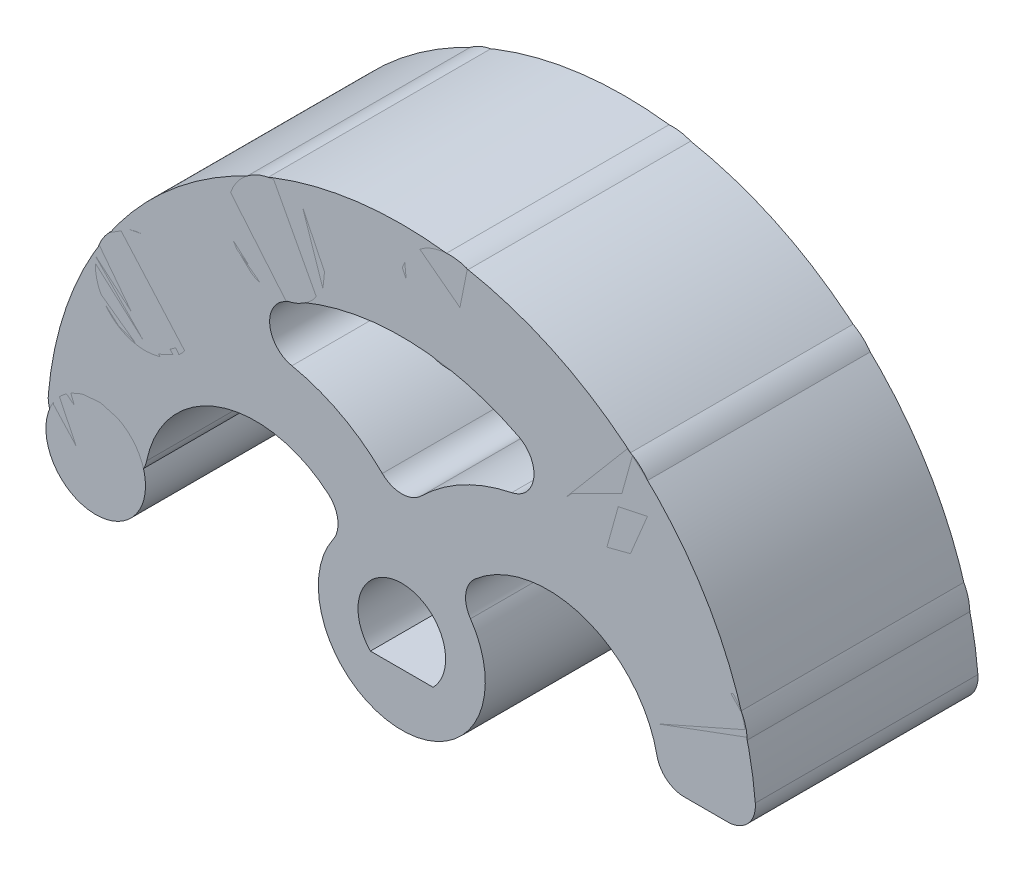
ISO-10303-21;
HEADER;
FILE_DESCRIPTION(('STEP AP214'),'2;1');
FILE_NAME('part.step','',(''),(''),'','','');
FILE_SCHEMA(('AUTOMOTIVE_DESIGN { 1 0 10303 214 1 1 1 1 }'));
ENDSEC;
DATA;
#1=APPLICATION_CONTEXT('core data for automotive mechanical design processes');
#2=APPLICATION_PROTOCOL_DEFINITION('international standard','automotive_design',2000,#1);
#3=PRODUCT_CONTEXT('',#1,'mechanical');
#4=PRODUCT('Part','Part','',(#3));
#5=PRODUCT_RELATED_PRODUCT_CATEGORY('part','',(#4));
#6=PRODUCT_DEFINITION_FORMATION('','',#4);
#7=PRODUCT_DEFINITION_CONTEXT('part definition',#1,'design');
#8=PRODUCT_DEFINITION('design','',#6,#7);
#9=PRODUCT_DEFINITION_SHAPE('','',#8);
#10=(LENGTH_UNIT() NAMED_UNIT(*) SI_UNIT(.MILLI.,.METRE.));
#11=(NAMED_UNIT(*) PLANE_ANGLE_UNIT() SI_UNIT($,.RADIAN.));
#12=(NAMED_UNIT(*) SI_UNIT($,.STERADIAN.) SOLID_ANGLE_UNIT());
#13=UNCERTAINTY_MEASURE_WITH_UNIT(LENGTH_MEASURE(1.E-05),#10,'distance_accuracy_value','');
#14=(GEOMETRIC_REPRESENTATION_CONTEXT(3) GLOBAL_UNCERTAINTY_ASSIGNED_CONTEXT((#13)) GLOBAL_UNIT_ASSIGNED_CONTEXT((#10,
#11,#12)) REPRESENTATION_CONTEXT('',''));
#15=CARTESIAN_POINT('',(0.,0.,0.));
#16=DIRECTION('',(0.,0.,1.));
#17=DIRECTION('',(1.,0.,0.));
#18=AXIS2_PLACEMENT_3D('',#15,#16,#17);
#19=CARTESIAN_POINT('',(10.6251840891798,2.84700949612767,0.));
#20=DIRECTION('',(0.,0.,1.));
#21=DIRECTION('',(-0.96592582628907,-0.258819045102516,0.));
#22=AXIS2_PLACEMENT_3D('',#19,#20,#21);
#23=CYLINDRICAL_SURFACE('',#22,1.78981093410736);
#24=CARTESIAN_POINT('',(10.6251840891798,2.84700949612767,0.));
#25=DIRECTION('',(0.,0.,1.));
#26=DIRECTION('',(-0.96592582628907,-0.258819045102516,0.));
#27=AXIS2_PLACEMENT_3D('',#24,#25,#26);
#28=CIRCLE('',#27,1.78981093410736);
#29=CARTESIAN_POINT('',(8.8963594837509,2.38377233924796,0.));
#30=VERTEX_POINT('',#29);
#31=EDGE_CURVE('P0_E11',#30,#30,#28,.T.);
#32=ORIENTED_EDGE('',*,*,#31,.T.);
#33=EDGE_LOOP('',(#32));
#34=FACE_BOUND('',#33,.T.);
#35=CARTESIAN_POINT('',(10.6251840891798,2.84700949612767,8.));
#36=DIRECTION('',(0.,0.,1.));
#37=DIRECTION('',(-0.96592582628907,-0.258819045102516,0.));
#38=AXIS2_PLACEMENT_3D('',#35,#36,#37);
#39=CIRCLE('',#38,1.78981093410736);
#40=CARTESIAN_POINT('',(8.8963594837509,2.38377233924796,8.));
#41=VERTEX_POINT('',#40);
#42=EDGE_CURVE('P0_E47',#41,#41,#39,.T.);
#43=ORIENTED_EDGE('',*,*,#42,.F.);
#44=EDGE_LOOP('',(#43));
#45=FACE_BOUND('',#44,.T.);
#46=ADVANCED_FACE('P0_F44',(#34,#45),#23,.T.);
#47=CARTESIAN_POINT('',(10.6251840891798,2.84700949612767,0.));
#48=DIRECTION('',(0.,0.,1.));
#49=DIRECTION('',(-0.96592582628907,-0.258819045102516,0.));
#50=AXIS2_PLACEMENT_3D('',#47,#48,#49);
#51=PLANE('',#50);
#52=ORIENTED_EDGE('',*,*,#31,.F.);
#53=EDGE_LOOP('',(#52));
#54=FACE_BOUND('',#53,.T.);
#55=ADVANCED_FACE('P0_F59',(#54),#51,.F.);
#56=CARTESIAN_POINT('',(10.6251840891798,2.84700949612767,8.));
#57=DIRECTION('',(0.,0.,1.));
#58=DIRECTION('',(-0.96592582628907,-0.258819045102516,0.));
#59=AXIS2_PLACEMENT_3D('',#56,#57,#58);
#60=PLANE('',#59);
#61=ORIENTED_EDGE('',*,*,#42,.T.);
#62=EDGE_LOOP('',(#61));
#63=FACE_BOUND('',#62,.T.);
#64=ADVANCED_FACE('P0_F56',(#63),#60,.T.);
#65=CLOSED_SHELL('',(#46,#55,#64));
#66=MANIFOLD_SOLID_BREP('P0_B2',#65);
#67=CARTESIAN_POINT('',(7.36043666994747,8.17459308025131,0.));
#68=DIRECTION('',(0.,0.,1.));
#69=DIRECTION('',(-0.669130606358861,-0.743144825477392,0.));
#70=AXIS2_PLACEMENT_3D('',#67,#68,#69);
#71=CYLINDRICAL_SURFACE('',#70,1.78981093410736);
#72=CARTESIAN_POINT('',(7.36043666994747,8.17459308025131,0.));
#73=DIRECTION('',(0.,0.,1.));
#74=DIRECTION('',(-0.669130606358861,-0.743144825477392,0.));
#75=AXIS2_PLACEMENT_3D('',#72,#73,#74);
#76=CIRCLE('',#75,1.78981093410736);
#77=CARTESIAN_POINT('',(6.16281939434049,6.84450434598656,0.));
#78=VERTEX_POINT('',#77);
#79=EDGE_CURVE('P0_E43',#78,#78,#76,.T.);
#80=ORIENTED_EDGE('',*,*,#79,.T.);
#81=EDGE_LOOP('',(#80));
#82=FACE_BOUND('',#81,.T.);
#83=CARTESIAN_POINT('',(7.36043666994747,8.17459308025131,8.));
#84=DIRECTION('',(0.,0.,1.));
#85=DIRECTION('',(-0.669130606358861,-0.743144825477392,0.));
#86=AXIS2_PLACEMENT_3D('',#83,#84,#85);
#87=CIRCLE('',#86,1.78981093410736);
#88=CARTESIAN_POINT('',(6.16281939434049,6.84450434598656,8.));
#89=VERTEX_POINT('',#88);
#90=EDGE_CURVE('P0_E114',#89,#89,#87,.T.);
#91=ORIENTED_EDGE('',*,*,#90,.F.);
#92=EDGE_LOOP('',(#91));
#93=FACE_BOUND('',#92,.T.);
#94=ADVANCED_FACE('P0_F111',(#82,#93),#71,.T.);
#95=CARTESIAN_POINT('',(7.36043666994747,8.17459308025131,0.));
#96=DIRECTION('',(0.,0.,1.));
#97=DIRECTION('',(-0.669130606358861,-0.743144825477392,0.));
#98=AXIS2_PLACEMENT_3D('',#95,#96,#97);
#99=PLANE('',#98);
#100=ORIENTED_EDGE('',*,*,#79,.F.);
#101=EDGE_LOOP('',(#100));
#102=FACE_BOUND('',#101,.T.);
#103=ADVANCED_FACE('P0_F126',(#102),#99,.F.);
#104=CARTESIAN_POINT('',(7.36043666994747,8.17459308025131,8.));
#105=DIRECTION('',(0.,0.,1.));
#106=DIRECTION('',(-0.669130606358861,-0.743144825477392,0.));
#107=AXIS2_PLACEMENT_3D('',#104,#105,#106);
#108=PLANE('',#107);
#109=ORIENTED_EDGE('',*,*,#90,.T.);
#110=EDGE_LOOP('',(#109));
#111=FACE_BOUND('',#110,.T.);
#112=ADVANCED_FACE('P0_F123',(#111),#108,.T.);
#113=CLOSED_SHELL('',(#94,#103,#112));
#114=MANIFOLD_SOLID_BREP('P0_B6',#113);
#115=CARTESIAN_POINT('',(1.72077911544257,10.8645717465465,0.));
#116=DIRECTION('',(0.,0.,1.));
#117=DIRECTION('',(-0.156434465040234,-0.987688340595137,0.));
#118=AXIS2_PLACEMENT_3D('',#115,#116,#117);
#119=CYLINDRICAL_SURFACE('',#118,1.78981093410736);
#120=CARTESIAN_POINT('',(1.72077911544257,10.8645717465465,0.));
#121=DIRECTION('',(0.,0.,1.));
#122=DIRECTION('',(-0.156434465040234,-0.987688340595137,0.));
#123=AXIS2_PLACEMENT_3D('',#120,#121,#122);
#124=CIRCLE('',#123,1.78981093410736);
#125=CARTESIAN_POINT('',(1.44079099944233,9.09679635505897,0.));
#126=VERTEX_POINT('',#125);
#127=EDGE_CURVE('P0_E110',#126,#126,#124,.T.);
#128=ORIENTED_EDGE('',*,*,#127,.T.);
#129=EDGE_LOOP('',(#128));
#130=FACE_BOUND('',#129,.T.);
#131=CARTESIAN_POINT('',(1.72077911544257,10.8645717465465,8.));
#132=DIRECTION('',(0.,0.,1.));
#133=DIRECTION('',(-0.156434465040234,-0.987688340595137,0.));
#134=AXIS2_PLACEMENT_3D('',#131,#132,#133);
#135=CIRCLE('',#134,1.78981093410736);
#136=CARTESIAN_POINT('',(1.44079099944233,9.09679635505897,8.));
#137=VERTEX_POINT('',#136);
#138=EDGE_CURVE('P0_E181',#137,#137,#135,.T.);
#139=ORIENTED_EDGE('',*,*,#138,.F.);
#140=EDGE_LOOP('',(#139));
#141=FACE_BOUND('',#140,.T.);
#142=ADVANCED_FACE('P0_F178',(#130,#141),#119,.T.);
#143=CARTESIAN_POINT('',(1.72077911544257,10.8645717465465,0.));
#144=DIRECTION('',(0.,0.,1.));
#145=DIRECTION('',(-0.156434465040234,-0.987688340595137,0.));
#146=AXIS2_PLACEMENT_3D('',#143,#144,#145);
#147=PLANE('',#146);
#148=ORIENTED_EDGE('',*,*,#127,.F.);
#149=EDGE_LOOP('',(#148));
#150=FACE_BOUND('',#149,.T.);
#151=ADVANCED_FACE('P0_F193',(#150),#147,.F.);
#152=CARTESIAN_POINT('',(1.72077911544257,10.8645717465465,8.));
#153=DIRECTION('',(0.,0.,1.));
#154=DIRECTION('',(-0.156434465040234,-0.987688340595137,0.));
#155=AXIS2_PLACEMENT_3D('',#152,#153,#154);
#156=PLANE('',#155);
#157=ORIENTED_EDGE('',*,*,#138,.T.);
#158=EDGE_LOOP('',(#157));
#159=FACE_BOUND('',#158,.T.);
#160=ADVANCED_FACE('P0_F190',(#159),#156,.T.);
#161=CLOSED_SHELL('',(#142,#151,#160));
#162=MANIFOLD_SOLID_BREP('P0_B38',#161);
#163=CARTESIAN_POINT('',(-4.47410307383378,10.0490000340686,0.));
#164=DIRECTION('',(0.,0.,1.));
#165=DIRECTION('',(0.406736643075798,-0.913545457642602,0.));
#166=AXIS2_PLACEMENT_3D('',#163,#164,#165);
#167=CYLINDRICAL_SURFACE('',#166,1.78981093410736);
#168=CARTESIAN_POINT('',(-4.47410307383378,10.0490000340686,0.));
#169=DIRECTION('',(0.,0.,1.));
#170=DIRECTION('',(0.406736643075798,-0.913545457642602,0.));
#171=AXIS2_PLACEMENT_3D('',#168,#169,#170);
#172=CIRCLE('',#171,1.78981093410736);
#173=CARTESIAN_POINT('',(-3.74612138275459,8.41392638517577,0.));
#174=VERTEX_POINT('',#173);
#175=EDGE_CURVE('P0_E177',#174,#174,#172,.T.);
#176=ORIENTED_EDGE('',*,*,#175,.T.);
#177=EDGE_LOOP('',(#176));
#178=FACE_BOUND('',#177,.T.);
#179=CARTESIAN_POINT('',(-4.47410307383378,10.0490000340686,8.));
#180=DIRECTION('',(0.,0.,1.));
#181=DIRECTION('',(0.406736643075798,-0.913545457642602,0.));
#182=AXIS2_PLACEMENT_3D('',#179,#180,#181);
#183=CIRCLE('',#182,1.78981093410736);
#184=CARTESIAN_POINT('',(-3.74612138275459,8.41392638517577,8.));
#185=VERTEX_POINT('',#184);
#186=EDGE_CURVE('P0_E248',#185,#185,#183,.T.);
#187=ORIENTED_EDGE('',*,*,#186,.F.);
#188=EDGE_LOOP('',(#187));
#189=FACE_BOUND('',#188,.T.);
#190=ADVANCED_FACE('P0_F245',(#178,#189),#167,.T.);
#191=CARTESIAN_POINT('',(-4.47410307383378,10.0490000340686,0.));
#192=DIRECTION('',(0.,0.,1.));
#193=DIRECTION('',(0.406736643075798,-0.913545457642602,0.));
#194=AXIS2_PLACEMENT_3D('',#191,#192,#193);
#195=PLANE('',#194);
#196=ORIENTED_EDGE('',*,*,#175,.F.);
#197=EDGE_LOOP('',(#196));
#198=FACE_BOUND('',#197,.T.);
#199=ADVANCED_FACE('P0_F260',(#198),#195,.F.);
#200=CARTESIAN_POINT('',(-4.47410307383378,10.0490000340686,8.));
#201=DIRECTION('',(0.,0.,1.));
#202=DIRECTION('',(0.406736643075798,-0.913545457642602,0.));
#203=AXIS2_PLACEMENT_3D('',#200,#201,#202);
#204=PLANE('',#203);
#205=ORIENTED_EDGE('',*,*,#186,.T.);
#206=EDGE_LOOP('',(#205));
#207=FACE_BOUND('',#206,.T.);
#208=ADVANCED_FACE('P0_F257',(#207),#204,.T.);
#209=CLOSED_SHELL('',(#190,#199,#208));
#210=MANIFOLD_SOLID_BREP('P0_B105',#209);
#211=CARTESIAN_POINT('',(-9.22537624739966,5.99102938516531,0.));
#212=DIRECTION('',(0.,0.,1.));
#213=DIRECTION('',(0.838670567945423,-0.544639035015028,0.));
#214=AXIS2_PLACEMENT_3D('',#211,#212,#213);
#215=CYLINDRICAL_SURFACE('',#214,1.78981093410736);
#216=CARTESIAN_POINT('',(-9.22537624739966,5.99102938516531,0.));
#217=DIRECTION('',(0.,0.,1.));
#218=DIRECTION('',(0.838670567945423,-0.544639035015028,0.));
#219=AXIS2_PLACEMENT_3D('',#216,#217,#218);
#220=CIRCLE('',#219,1.78981093410736);
#221=CARTESIAN_POINT('',(-7.72431449477691,5.01622848515373,0.));
#222=VERTEX_POINT('',#221);
#223=EDGE_CURVE('P0_E244',#222,#222,#220,.T.);
#224=ORIENTED_EDGE('',*,*,#223,.T.);
#225=EDGE_LOOP('',(#224));
#226=FACE_BOUND('',#225,.T.);
#227=CARTESIAN_POINT('',(-9.22537624739966,5.99102938516531,8.));
#228=DIRECTION('',(0.,0.,1.));
#229=DIRECTION('',(0.838670567945423,-0.544639035015028,0.));
#230=AXIS2_PLACEMENT_3D('',#227,#228,#229);
#231=CIRCLE('',#230,1.78981093410736);
#232=CARTESIAN_POINT('',(-7.72431449477691,5.01622848515373,8.));
#233=VERTEX_POINT('',#232);
#234=EDGE_CURVE('P0_E314',#233,#233,#231,.T.);
#235=ORIENTED_EDGE('',*,*,#234,.F.);
#236=EDGE_LOOP('',(#235));
#237=FACE_BOUND('',#236,.T.);
#238=ADVANCED_FACE('P0_F311',(#226,#237),#215,.T.);
#239=CARTESIAN_POINT('',(-9.22537624739966,5.99102938516531,0.));
#240=DIRECTION('',(0.,0.,1.));
#241=DIRECTION('',(0.838670567945423,-0.544639035015028,0.));
#242=AXIS2_PLACEMENT_3D('',#239,#240,#241);
#243=PLANE('',#242);
#244=ORIENTED_EDGE('',*,*,#223,.F.);
#245=EDGE_LOOP('',(#244));
#246=FACE_BOUND('',#245,.T.);
#247=ADVANCED_FACE('P0_F326',(#246),#243,.F.);
#248=CARTESIAN_POINT('',(-9.22537624739966,5.99102938516531,8.));
#249=DIRECTION('',(0.,0.,1.));
#250=DIRECTION('',(0.838670567945423,-0.544639035015028,0.));
#251=AXIS2_PLACEMENT_3D('',#248,#249,#250);
#252=PLANE('',#251);
#253=ORIENTED_EDGE('',*,*,#234,.T.);
#254=EDGE_LOOP('',(#253));
#255=FACE_BOUND('',#254,.T.);
#256=ADVANCED_FACE('P0_F323',(#255),#252,.T.);
#257=CLOSED_SHELL('',(#238,#247,#256));
#258=MANIFOLD_SOLID_BREP('P0_B172',#257);
#259=CARTESIAN_POINT('',(-11.,0.,0.));
#260=DIRECTION('',(0.,0.,1.));
#261=DIRECTION('',(1.,0.,0.));
#262=AXIS2_PLACEMENT_3D('',#259,#260,#261);
#263=CYLINDRICAL_SURFACE('',#262,1.78981093410736);
#264=CARTESIAN_POINT('',(-11.,0.,0.));
#265=DIRECTION('',(0.,0.,1.));
#266=DIRECTION('',(1.,0.,0.));
#267=AXIS2_PLACEMENT_3D('',#264,#265,#266);
#268=CIRCLE('',#267,1.78981093410736);
#269=CARTESIAN_POINT('',(-9.21018906589264,0.,0.));
#270=VERTEX_POINT('',#269);
#271=EDGE_CURVE('P0_E310',#270,#270,#268,.T.);
#272=ORIENTED_EDGE('',*,*,#271,.T.);
#273=EDGE_LOOP('',(#272));
#274=FACE_BOUND('',#273,.T.);
#275=CARTESIAN_POINT('',(-11.,0.,8.));
#276=DIRECTION('',(0.,0.,1.));
#277=DIRECTION('',(1.,0.,0.));
#278=AXIS2_PLACEMENT_3D('',#275,#276,#277);
#279=CIRCLE('',#278,1.78981093410736);
#280=CARTESIAN_POINT('',(-9.21018906589264,0.,8.));
#281=VERTEX_POINT('',#280);
#282=EDGE_CURVE('P0_E373',#281,#281,#279,.T.);
#283=ORIENTED_EDGE('',*,*,#282,.F.);
#284=EDGE_LOOP('',(#283));
#285=FACE_BOUND('',#284,.T.);
#286=ADVANCED_FACE('P0_F370',(#274,#285),#263,.T.);
#287=CARTESIAN_POINT('',(-11.,0.,0.));
#288=DIRECTION('',(0.,0.,1.));
#289=DIRECTION('',(1.,0.,0.));
#290=AXIS2_PLACEMENT_3D('',#287,#288,#289);
#291=PLANE('',#290);
#292=ORIENTED_EDGE('',*,*,#271,.F.);
#293=EDGE_LOOP('',(#292));
#294=FACE_BOUND('',#293,.T.);
#295=ADVANCED_FACE('P0_F385',(#294),#291,.F.);
#296=CARTESIAN_POINT('',(-11.,0.,8.));
#297=DIRECTION('',(0.,0.,1.));
#298=DIRECTION('',(1.,0.,0.));
#299=AXIS2_PLACEMENT_3D('',#296,#297,#298);
#300=PLANE('',#299);
#301=ORIENTED_EDGE('',*,*,#282,.T.);
#302=EDGE_LOOP('',(#301));
#303=FACE_BOUND('',#302,.T.);
#304=ADVANCED_FACE('P0_F382',(#303),#300,.T.);
#305=CLOSED_SHELL('',(#286,#295,#304));
#306=MANIFOLD_SOLID_BREP('P0_B239',#305);
#307=CARTESIAN_POINT('',(11.7073694739681,1.,8.));
#308=DIRECTION('',(0.,0.,1.));
#309=DIRECTION('',(1.,0.,0.));
#310=AXIS2_PLACEMENT_3D('',#307,#308,#309);
#311=CYLINDRICAL_SURFACE('',#310,1.);
#312=CARTESIAN_POINT('',(11.7073694739681,1.,8.));
#313=DIRECTION('',(0.,0.,-1.));
#314=DIRECTION('',(0.,-1.,0.));
#315=AXIS2_PLACEMENT_3D('',#312,#313,#314);
#316=CIRCLE('',#315,1.);
#317=CARTESIAN_POINT('',(12.703741344093,1.08510638297872,8.));
#318=VERTEX_POINT('',#317);
#319=CARTESIAN_POINT('',(11.7073694739681,0.,8.));
#320=VERTEX_POINT('',#319);
#321=EDGE_CURVE('P1_E11',#318,#320,#316,.T.);
#322=ORIENTED_EDGE('',*,*,#321,.T.);
#323=DIRECTION('',(0.,0.,-1.));
#324=VECTOR('',#323,1.);
#325=CARTESIAN_POINT('',(11.7073694739681,0.,8.));
#326=LINE('',#325,#324);
#327=CARTESIAN_POINT('',(11.7073694739681,0.,0.));
#328=VERTEX_POINT('',#327);
#329=EDGE_CURVE('P1_E26',#320,#328,#326,.T.);
#330=ORIENTED_EDGE('',*,*,#329,.T.);
#331=CARTESIAN_POINT('',(11.7073694739681,1.,0.));
#332=DIRECTION('',(0.,0.,1.));
#333=DIRECTION('',(1.,0.,0.));
#334=AXIS2_PLACEMENT_3D('',#331,#332,#333);
#335=CIRCLE('',#334,1.);
#336=CARTESIAN_POINT('',(12.703741344093,1.08510638297872,0.));
#337=VERTEX_POINT('',#336);
#338=EDGE_CURVE('P1_E324',#328,#337,#335,.T.);
#339=ORIENTED_EDGE('',*,*,#338,.T.);
#340=DIRECTION('',(0.,0.,1.));
#341=VECTOR('',#340,1.);
#342=CARTESIAN_POINT('',(12.703741344093,1.08510638297872,8.));
#343=LINE('',#342,#341);
#344=EDGE_CURVE('P1_E325',#337,#318,#343,.T.);
#345=ORIENTED_EDGE('',*,*,#344,.T.);
#346=EDGE_LOOP('',(#322,#330,#339,#345));
#347=FACE_BOUND('',#346,.T.);
#348=ADVANCED_FACE('P1_F16',(#347),#311,.T.);
#349=CARTESIAN_POINT('',(0.,0.,8.));
#350=DIRECTION('',(0.,0.,-1.));
#351=DIRECTION('',(0.,-1.,0.));
#352=AXIS2_PLACEMENT_3D('',#349,#350,#351);
#353=CYLINDRICAL_SURFACE('',#352,12.75);
#354=ORIENTED_EDGE('',*,*,#344,.F.);
#355=CARTESIAN_POINT('',(0.,0.,0.));
#356=DIRECTION('',(0.,0.,-1.));
#357=DIRECTION('',(0.,-1.,0.));
#358=AXIS2_PLACEMENT_3D('',#355,#356,#357);
#359=CIRCLE('',#358,12.75);
#360=CARTESIAN_POINT('',(-12.703741344093,1.08510638297872,0.));
#361=VERTEX_POINT('',#360);
#362=EDGE_CURVE('P1_E207',#361,#337,#359,.T.);
#363=ORIENTED_EDGE('',*,*,#362,.F.);
#364=DIRECTION('',(0.,0.,-1.));
#365=VECTOR('',#364,1.);
#366=CARTESIAN_POINT('',(-12.703741344093,1.08510638297872,8.));
#367=LINE('',#366,#365);
#368=CARTESIAN_POINT('',(-12.703741344093,1.08510638297872,8.));
#369=VERTEX_POINT('',#368);
#370=EDGE_CURVE('P1_E242',#369,#361,#367,.T.);
#371=ORIENTED_EDGE('',*,*,#370,.F.);
#372=CARTESIAN_POINT('',(0.,0.,8.));
#373=DIRECTION('',(0.,0.,1.));
#374=DIRECTION('',(0.,-1.,0.));
#375=AXIS2_PLACEMENT_3D('',#372,#373,#374);
#376=CIRCLE('',#375,12.75);
#377=EDGE_CURVE('P1_E303',#318,#369,#376,.T.);
#378=ORIENTED_EDGE('',*,*,#377,.F.);
#379=EDGE_LOOP('',(#354,#363,#371,#378));
#380=FACE_BOUND('',#379,.T.);
#381=ADVANCED_FACE('P1_F337',(#380),#353,.T.);
#382=CARTESIAN_POINT('',(0.,0.,0.));
#383=DIRECTION('',(0.,0.,1.));
#384=DIRECTION('',(1.,0.,0.));
#385=AXIS2_PLACEMENT_3D('',#382,#383,#384);
#386=PLANE('',#385);
#387=ORIENTED_EDGE('',*,*,#338,.F.);
#388=DIRECTION('',(-1.,0.,0.));
#389=VECTOR('',#388,1.);
#390=CARTESIAN_POINT('',(9.25,0.,0.));
#391=LINE('',#390,#389);
#392=CARTESIAN_POINT('',(10.1489794855664,0.,0.));
#393=VERTEX_POINT('',#392);
#394=EDGE_CURVE('P1_E182',#328,#393,#391,.T.);
#395=ORIENTED_EDGE('',*,*,#394,.T.);
#396=CARTESIAN_POINT('',(10.1489794855664,1.,0.));
#397=DIRECTION('',(0.,0.,1.));
#398=DIRECTION('',(1.,0.,0.));
#399=AXIS2_PLACEMENT_3D('',#396,#397,#398);
#400=CIRCLE('',#399,1.);
#401=CARTESIAN_POINT('',(9.16918358845309,0.800000000000001,0.));
#402=VERTEX_POINT('',#401);
#403=EDGE_CURVE('P1_E173',#402,#393,#400,.T.);
#404=ORIENTED_EDGE('',*,*,#403,.F.);
#405=CARTESIAN_POINT('',(5.25,0.,0.));
#406=DIRECTION('',(0.,0.,1.));
#407=DIRECTION('',(1.,0.,0.));
#408=AXIS2_PLACEMENT_3D('',#405,#406,#407);
#409=CIRCLE('',#408,4.);
#410=CARTESIAN_POINT('',(2.63888888888889,3.03019780962103,0.));
#411=VERTEX_POINT('',#410);
#412=EDGE_CURVE('P1_E184',#402,#411,#409,.T.);
#413=ORIENTED_EDGE('',*,*,#412,.T.);
#414=CARTESIAN_POINT('',(3.29166666666667,2.27264835721577,0.));
#415=DIRECTION('',(0.,0.,-1.));
#416=DIRECTION('',(0.,-1.,0.));
#417=AXIS2_PLACEMENT_3D('',#414,#415,#416);
#418=CIRCLE('',#417,1.);
#419=CARTESIAN_POINT('',(2.46875,1.70448626791183,0.));
#420=VERTEX_POINT('',#419);
#421=EDGE_CURVE('P1_E188',#420,#411,#418,.T.);
#422=ORIENTED_EDGE('',*,*,#421,.F.);
#423=CARTESIAN_POINT('',(0.,0.,0.));
#424=DIRECTION('',(0.,0.,-1.));
#425=DIRECTION('',(0.,-1.,0.));
#426=AXIS2_PLACEMENT_3D('',#423,#424,#425);
#427=CIRCLE('',#426,3.);
#428=CARTESIAN_POINT('',(-2.46875,1.70448626791183,0.));
#429=VERTEX_POINT('',#428);
#430=EDGE_CURVE('P1_E187',#420,#429,#427,.T.);
#431=ORIENTED_EDGE('',*,*,#430,.T.);
#432=CARTESIAN_POINT('',(-3.29166666666667,2.27264835721577,0.));
#433=DIRECTION('',(0.,0.,-1.));
#434=DIRECTION('',(0.,-1.,0.));
#435=AXIS2_PLACEMENT_3D('',#432,#433,#434);
#436=CIRCLE('',#435,1.);
#437=CARTESIAN_POINT('',(-2.63888888888889,3.03019780962103,0.));
#438=VERTEX_POINT('',#437);
#439=EDGE_CURVE('P1_E195',#438,#429,#436,.T.);
#440=ORIENTED_EDGE('',*,*,#439,.F.);
#441=CARTESIAN_POINT('',(-5.25,0.,0.));
#442=DIRECTION('',(0.,0.,1.));
#443=DIRECTION('',(1.,0.,0.));
#444=AXIS2_PLACEMENT_3D('',#441,#442,#443);
#445=CIRCLE('',#444,4.);
#446=CARTESIAN_POINT('',(-9.16918358845309,0.8,0.));
#447=VERTEX_POINT('',#446);
#448=EDGE_CURVE('P1_E194',#438,#447,#445,.T.);
#449=ORIENTED_EDGE('',*,*,#448,.T.);
#450=CARTESIAN_POINT('',(-10.1489794855664,1.,0.));
#451=DIRECTION('',(0.,0.,1.));
#452=DIRECTION('',(1.,0.,0.));
#453=AXIS2_PLACEMENT_3D('',#450,#451,#452);
#454=CIRCLE('',#453,1.);
#455=CARTESIAN_POINT('',(-10.1489794855664,0.,0.));
#456=VERTEX_POINT('',#455);
#457=EDGE_CURVE('P1_E201',#456,#447,#454,.T.);
#458=ORIENTED_EDGE('',*,*,#457,.F.);
#459=DIRECTION('',(-1.,0.,0.));
#460=VECTOR('',#459,1.);
#461=CARTESIAN_POINT('',(-11.75,0.,0.));
#462=LINE('',#461,#460);
#463=CARTESIAN_POINT('',(-11.7073694739681,0.,0.));
#464=VERTEX_POINT('',#463);
#465=EDGE_CURVE('P1_E200',#456,#464,#462,.T.);
#466=ORIENTED_EDGE('',*,*,#465,.T.);
#467=CARTESIAN_POINT('',(-11.7073694739681,0.999999999999999,0.));
#468=DIRECTION('',(0.,0.,1.));
#469=DIRECTION('',(1.,0.,0.));
#470=AXIS2_PLACEMENT_3D('',#467,#468,#469);
#471=CIRCLE('',#470,1.);
#472=EDGE_CURVE('P1_E208',#361,#464,#471,.T.);
#473=ORIENTED_EDGE('',*,*,#472,.F.);
#474=ORIENTED_EDGE('',*,*,#362,.T.);
#475=EDGE_LOOP('',(#387,#395,#404,#413,#422,#431,#440,#449,#458,#466,#473,#474));
#476=FACE_BOUND('',#475,.T.);
#477=CARTESIAN_POINT('',(5.25,0.,0.));
#478=DIRECTION('',(0.,0.,-1.));
#479=DIRECTION('',(0.,-1.,0.));
#480=AXIS2_PLACEMENT_3D('',#477,#478,#479);
#481=CIRCLE('',#480,6.5);
#482=CARTESIAN_POINT('',(0.700000000000001,4.64192847855285,0.));
#483=VERTEX_POINT('',#482);
#484=CARTESIAN_POINT('',(3.95,6.36867333123626,0.));
#485=VERTEX_POINT('',#484);
#486=EDGE_CURVE('P1_E212',#483,#485,#481,.T.);
#487=ORIENTED_EDGE('',*,*,#486,.T.);
#488=CARTESIAN_POINT('',(3.75,7.34846922834953,0.));
#489=DIRECTION('',(0.,0.,-1.));
#490=DIRECTION('',(0.,-1.,0.));
#491=AXIS2_PLACEMENT_3D('',#488,#489,#490);
#492=CIRCLE('',#491,1.);
#493=CARTESIAN_POINT('',(4.20454545454546,8.23919277117978,0.));
#494=VERTEX_POINT('',#493);
#495=EDGE_CURVE('P1_E216',#494,#485,#492,.T.);
#496=ORIENTED_EDGE('',*,*,#495,.F.);
#497=CARTESIAN_POINT('',(0.,0.,0.));
#498=DIRECTION('',(0.,0.,1.));
#499=DIRECTION('',(1.,0.,0.));
#500=AXIS2_PLACEMENT_3D('',#497,#498,#499);
#501=CIRCLE('',#500,9.25);
#502=CARTESIAN_POINT('',(-4.20454545454546,8.23919277117978,0.));
#503=VERTEX_POINT('',#502);
#504=EDGE_CURVE('P1_E215',#494,#503,#501,.T.);
#505=ORIENTED_EDGE('',*,*,#504,.T.);
#506=CARTESIAN_POINT('',(-3.75,7.34846922834953,0.));
#507=DIRECTION('',(0.,0.,-1.));
#508=DIRECTION('',(0.,-1.,0.));
#509=AXIS2_PLACEMENT_3D('',#506,#507,#508);
#510=CIRCLE('',#509,1.);
#511=CARTESIAN_POINT('',(-3.95,6.36867333123626,0.));
#512=VERTEX_POINT('',#511);
#513=EDGE_CURVE('P1_E223',#512,#503,#510,.T.);
#514=ORIENTED_EDGE('',*,*,#513,.F.);
#515=CARTESIAN_POINT('',(-5.25,0.,0.));
#516=DIRECTION('',(0.,0.,-1.));
#517=DIRECTION('',(0.,-1.,0.));
#518=AXIS2_PLACEMENT_3D('',#515,#516,#517);
#519=CIRCLE('',#518,6.5);
#520=CARTESIAN_POINT('',(-0.7,4.64192847855285,0.));
#521=VERTEX_POINT('',#520);
#522=EDGE_CURVE('P1_E222',#512,#521,#519,.T.);
#523=ORIENTED_EDGE('',*,*,#522,.T.);
#524=CARTESIAN_POINT('',(0.,5.35607132140714,0.));
#525=DIRECTION('',(0.,0.,-1.));
#526=DIRECTION('',(0.,-1.,0.));
#527=AXIS2_PLACEMENT_3D('',#524,#525,#526);
#528=CIRCLE('',#527,1.);
#529=EDGE_CURVE('P1_E230',#483,#521,#528,.T.);
#530=ORIENTED_EDGE('',*,*,#529,.F.);
#531=EDGE_LOOP('',(#487,#496,#505,#514,#523,#530));
#532=FACE_BOUND('',#531,.T.);
#533=CARTESIAN_POINT('',(0.,0.,0.));
#534=DIRECTION('',(0.,0.,1.));
#535=DIRECTION('',(1.,0.,0.));
#536=AXIS2_PLACEMENT_3D('',#533,#534,#535);
#537=CIRCLE('',#536,1.575);
#538=CARTESIAN_POINT('',(1.12722003175955,-1.1,0.));
#539=VERTEX_POINT('',#538);
#540=CARTESIAN_POINT('',(-1.12722003175955,-1.1,0.));
#541=VERTEX_POINT('',#540);
#542=EDGE_CURVE('P1_E229',#539,#541,#537,.T.);
#543=ORIENTED_EDGE('',*,*,#542,.T.);
#544=DIRECTION('',(1.,0.,0.));
#545=VECTOR('',#544,1.);
#546=CARTESIAN_POINT('',(1.12722003175955,-1.1,0.));
#547=LINE('',#546,#545);
#548=EDGE_CURVE('P1_E210',#541,#539,#547,.T.);
#549=ORIENTED_EDGE('',*,*,#548,.T.);
#550=EDGE_LOOP('',(#543,#549));
#551=FACE_BOUND('',#550,.T.);
#552=ADVANCED_FACE('P1_F320',(#476,#532,#551),#386,.F.);
#553=CARTESIAN_POINT('',(-11.7073694739681,0.999999999999999,8.));
#554=DIRECTION('',(0.,0.,-1.));
#555=DIRECTION('',(0.,-1.,0.));
#556=AXIS2_PLACEMENT_3D('',#553,#554,#555);
#557=CYLINDRICAL_SURFACE('',#556,1.);
#558=ORIENTED_EDGE('',*,*,#472,.T.);
#559=DIRECTION('',(0.,0.,1.));
#560=VECTOR('',#559,1.);
#561=CARTESIAN_POINT('',(-11.7073694739681,0.,8.));
#562=LINE('',#561,#560);
#563=CARTESIAN_POINT('',(-11.7073694739681,0.,8.));
#564=VERTEX_POINT('',#563);
#565=EDGE_CURVE('P1_E211',#464,#564,#562,.T.);
#566=ORIENTED_EDGE('',*,*,#565,.T.);
#567=CARTESIAN_POINT('',(-11.7073694739681,0.999999999999999,8.));
#568=DIRECTION('',(0.,0.,-1.));
#569=DIRECTION('',(0.,-1.,0.));
#570=AXIS2_PLACEMENT_3D('',#567,#568,#569);
#571=CIRCLE('',#570,1.);
#572=EDGE_CURVE('P1_E239',#564,#369,#571,.T.);
#573=ORIENTED_EDGE('',*,*,#572,.T.);
#574=ORIENTED_EDGE('',*,*,#370,.T.);
#575=EDGE_LOOP('',(#558,#566,#573,#574));
#576=FACE_BOUND('',#575,.T.);
#577=ADVANCED_FACE('P1_F340',(#576),#557,.T.);
#578=CARTESIAN_POINT('',(-1.12722003175955,-1.1,8.));
#579=DIRECTION('',(0.,1.,0.));
#580=DIRECTION('',(0.,0.,1.));
#581=AXIS2_PLACEMENT_3D('',#578,#579,#580);
#582=PLANE('',#581);
#583=DIRECTION('',(-1.,0.,0.));
#584=VECTOR('',#583,1.);
#585=CARTESIAN_POINT('',(1.12722003175955,-1.1,8.));
#586=LINE('',#585,#584);
#587=CARTESIAN_POINT('',(1.12722003175955,-1.1,8.));
#588=VERTEX_POINT('',#587);
#589=CARTESIAN_POINT('',(-1.12722003175955,-1.1,8.));
#590=VERTEX_POINT('',#589);
#591=EDGE_CURVE('P1_E243',#588,#590,#586,.T.);
#592=ORIENTED_EDGE('',*,*,#591,.F.);
#593=DIRECTION('',(0.,0.,1.));
#594=VECTOR('',#593,1.);
#595=CARTESIAN_POINT('',(1.12722003175955,-1.1,0.));
#596=LINE('',#595,#594);
#597=EDGE_CURVE('P1_E246',#539,#588,#596,.T.);
#598=ORIENTED_EDGE('',*,*,#597,.F.);
#599=ORIENTED_EDGE('',*,*,#548,.F.);
#600=DIRECTION('',(0.,0.,-1.));
#601=VECTOR('',#600,1.);
#602=CARTESIAN_POINT('',(-1.12722003175955,-1.1,0.));
#603=LINE('',#602,#601);
#604=EDGE_CURVE('P1_E249',#590,#541,#603,.T.);
#605=ORIENTED_EDGE('',*,*,#604,.F.);
#606=EDGE_LOOP('',(#592,#598,#599,#605));
#607=FACE_BOUND('',#606,.T.);
#608=ADVANCED_FACE('P1_F381',(#607),#582,.T.);
#609=CARTESIAN_POINT('',(0.,0.,0.));
#610=DIRECTION('',(0.,0.,1.));
#611=DIRECTION('',(1.,0.,0.));
#612=AXIS2_PLACEMENT_3D('',#609,#610,#611);
#613=CYLINDRICAL_SURFACE('',#612,1.575);
#614=ORIENTED_EDGE('',*,*,#597,.T.);
#615=CARTESIAN_POINT('',(0.,0.,8.));
#616=DIRECTION('',(0.,0.,-1.));
#617=DIRECTION('',(0.,-1.,0.));
#618=AXIS2_PLACEMENT_3D('',#615,#616,#617);
#619=CIRCLE('',#618,1.575);
#620=EDGE_CURVE('P1_E171',#590,#588,#619,.T.);
#621=ORIENTED_EDGE('',*,*,#620,.F.);
#622=ORIENTED_EDGE('',*,*,#604,.T.);
#623=ORIENTED_EDGE('',*,*,#542,.F.);
#624=EDGE_LOOP('',(#614,#621,#622,#623));
#625=FACE_BOUND('',#624,.T.);
#626=ADVANCED_FACE('P1_F378',(#625),#613,.F.);
#627=CARTESIAN_POINT('',(3.75,7.34846922834953,8.));
#628=DIRECTION('',(0.,0.,-1.));
#629=DIRECTION('',(0.,-1.,0.));
#630=AXIS2_PLACEMENT_3D('',#627,#628,#629);
#631=CYLINDRICAL_SURFACE('',#630,1.);
#632=CARTESIAN_POINT('',(3.75,7.34846922834953,8.));
#633=DIRECTION('',(0.,0.,1.));
#634=DIRECTION('',(1.,0.,0.));
#635=AXIS2_PLACEMENT_3D('',#632,#633,#634);
#636=CIRCLE('',#635,1.);
#637=CARTESIAN_POINT('',(3.95,6.36867333123626,8.));
#638=VERTEX_POINT('',#637);
#639=CARTESIAN_POINT('',(4.20454545454546,8.23919277117978,8.));
#640=VERTEX_POINT('',#639);
#641=EDGE_CURVE('P1_E252',#638,#640,#636,.T.);
#642=ORIENTED_EDGE('',*,*,#641,.T.);
#643=DIRECTION('',(0.,0.,-1.));
#644=VECTOR('',#643,1.);
#645=CARTESIAN_POINT('',(4.20454545454546,8.23919277117978,8.));
#646=LINE('',#645,#644);
#647=EDGE_CURVE('P1_E218',#640,#494,#646,.T.);
#648=ORIENTED_EDGE('',*,*,#647,.T.);
#649=ORIENTED_EDGE('',*,*,#495,.T.);
#650=DIRECTION('',(0.,0.,1.));
#651=VECTOR('',#650,1.);
#652=CARTESIAN_POINT('',(3.95,6.36867333123626,8.));
#653=LINE('',#652,#651);
#654=EDGE_CURVE('P1_E219',#485,#638,#653,.T.);
#655=ORIENTED_EDGE('',*,*,#654,.T.);
#656=EDGE_LOOP('',(#642,#648,#649,#655));
#657=FACE_BOUND('',#656,.T.);
#658=ADVANCED_FACE('P1_F380',(#657),#631,.F.);
#659=CARTESIAN_POINT('',(0.,0.,8.));
#660=DIRECTION('',(0.,0.,-1.));
#661=DIRECTION('',(0.,-1.,0.));
#662=AXIS2_PLACEMENT_3D('',#659,#660,#661);
#663=CYLINDRICAL_SURFACE('',#662,9.25);
#664=ORIENTED_EDGE('',*,*,#647,.F.);
#665=CARTESIAN_POINT('',(0.,0.,8.));
#666=DIRECTION('',(0.,0.,-1.));
#667=DIRECTION('',(0.,-1.,0.));
#668=AXIS2_PLACEMENT_3D('',#665,#666,#667);
#669=CIRCLE('',#668,9.25);
#670=CARTESIAN_POINT('',(-4.20454545454546,8.23919277117978,8.));
#671=VERTEX_POINT('',#670);
#672=EDGE_CURVE('P1_E175',#671,#640,#669,.T.);
#673=ORIENTED_EDGE('',*,*,#672,.F.);
#674=DIRECTION('',(0.,0.,1.));
#675=VECTOR('',#674,1.);
#676=CARTESIAN_POINT('',(-4.20454545454546,8.23919277117978,8.));
#677=LINE('',#676,#675);
#678=EDGE_CURVE('P1_E226',#503,#671,#677,.T.);
#679=ORIENTED_EDGE('',*,*,#678,.F.);
#680=ORIENTED_EDGE('',*,*,#504,.F.);
#681=EDGE_LOOP('',(#664,#673,#679,#680));
#682=FACE_BOUND('',#681,.T.);
#683=ADVANCED_FACE('P1_F384',(#682),#663,.F.);
#684=CARTESIAN_POINT('',(-3.75,7.34846922834953,8.));
#685=DIRECTION('',(0.,0.,-1.));
#686=DIRECTION('',(0.,-1.,0.));
#687=AXIS2_PLACEMENT_3D('',#684,#685,#686);
#688=CYLINDRICAL_SURFACE('',#687,1.);
#689=CARTESIAN_POINT('',(-3.75,7.34846922834953,8.));
#690=DIRECTION('',(0.,0.,1.));
#691=DIRECTION('',(1.,0.,0.));
#692=AXIS2_PLACEMENT_3D('',#689,#690,#691);
#693=CIRCLE('',#692,1.);
#694=CARTESIAN_POINT('',(-3.95,6.36867333123626,8.));
#695=VERTEX_POINT('',#694);
#696=EDGE_CURVE('P1_E259',#671,#695,#693,.T.);
#697=ORIENTED_EDGE('',*,*,#696,.T.);
#698=DIRECTION('',(0.,0.,-1.));
#699=VECTOR('',#698,1.);
#700=CARTESIAN_POINT('',(-3.95,6.36867333123626,8.));
#701=LINE('',#700,#699);
#702=EDGE_CURVE('P1_E225',#695,#512,#701,.T.);
#703=ORIENTED_EDGE('',*,*,#702,.T.);
#704=ORIENTED_EDGE('',*,*,#513,.T.);
#705=ORIENTED_EDGE('',*,*,#678,.T.);
#706=EDGE_LOOP('',(#697,#703,#704,#705));
#707=FACE_BOUND('',#706,.T.);
#708=ADVANCED_FACE('P1_F376',(#707),#688,.F.);
#709=CARTESIAN_POINT('',(-5.25,0.,8.));
#710=DIRECTION('',(0.,0.,-1.));
#711=DIRECTION('',(0.,-1.,0.));
#712=AXIS2_PLACEMENT_3D('',#709,#710,#711);
#713=CYLINDRICAL_SURFACE('',#712,6.5);
#714=ORIENTED_EDGE('',*,*,#702,.F.);
#715=CARTESIAN_POINT('',(-5.25,0.,8.));
#716=DIRECTION('',(0.,0.,1.));
#717=DIRECTION('',(1.,0.,0.));
#718=AXIS2_PLACEMENT_3D('',#715,#716,#717);
#719=CIRCLE('',#718,6.5);
#720=CARTESIAN_POINT('',(-0.7,4.64192847855285,8.));
#721=VERTEX_POINT('',#720);
#722=EDGE_CURVE('P1_E178',#721,#695,#719,.T.);
#723=ORIENTED_EDGE('',*,*,#722,.F.);
#724=DIRECTION('',(0.,0.,1.));
#725=VECTOR('',#724,1.);
#726=CARTESIAN_POINT('',(-0.7,4.64192847855285,8.));
#727=LINE('',#726,#725);
#728=EDGE_CURVE('P1_E233',#521,#721,#727,.T.);
#729=ORIENTED_EDGE('',*,*,#728,.F.);
#730=ORIENTED_EDGE('',*,*,#522,.F.);
#731=EDGE_LOOP('',(#714,#723,#729,#730));
#732=FACE_BOUND('',#731,.T.);
#733=ADVANCED_FACE('P1_F373',(#732),#713,.T.);
#734=CARTESIAN_POINT('',(0.,5.35607132140714,8.));
#735=DIRECTION('',(0.,0.,-1.));
#736=DIRECTION('',(0.,-1.,0.));
#737=AXIS2_PLACEMENT_3D('',#734,#735,#736);
#738=CYLINDRICAL_SURFACE('',#737,1.);
#739=CARTESIAN_POINT('',(0.,5.35607132140714,8.));
#740=DIRECTION('',(0.,0.,1.));
#741=DIRECTION('',(1.,0.,0.));
#742=AXIS2_PLACEMENT_3D('',#739,#740,#741);
#743=CIRCLE('',#742,1.);
#744=CARTESIAN_POINT('',(0.700000000000001,4.64192847855285,8.));
#745=VERTEX_POINT('',#744);
#746=EDGE_CURVE('P1_E263',#721,#745,#743,.T.);
#747=ORIENTED_EDGE('',*,*,#746,.T.);
#748=DIRECTION('',(0.,0.,-1.));
#749=VECTOR('',#748,1.);
#750=CARTESIAN_POINT('',(0.7,4.64192847855285,8.));
#751=LINE('',#750,#749);
#752=EDGE_CURVE('P1_E232',#745,#483,#751,.T.);
#753=ORIENTED_EDGE('',*,*,#752,.T.);
#754=ORIENTED_EDGE('',*,*,#529,.T.);
#755=ORIENTED_EDGE('',*,*,#728,.T.);
#756=EDGE_LOOP('',(#747,#753,#754,#755));
#757=FACE_BOUND('',#756,.T.);
#758=ADVANCED_FACE('P1_F18',(#757),#738,.F.);
#759=CARTESIAN_POINT('',(5.25,0.,8.));
#760=DIRECTION('',(0.,0.,-1.));
#761=DIRECTION('',(0.,-1.,0.));
#762=AXIS2_PLACEMENT_3D('',#759,#760,#761);
#763=CYLINDRICAL_SURFACE('',#762,6.5);
#764=ORIENTED_EDGE('',*,*,#654,.F.);
#765=ORIENTED_EDGE('',*,*,#486,.F.);
#766=ORIENTED_EDGE('',*,*,#752,.F.);
#767=CARTESIAN_POINT('',(5.25,0.,8.));
#768=DIRECTION('',(0.,0.,1.));
#769=DIRECTION('',(1.,0.,0.));
#770=AXIS2_PLACEMENT_3D('',#767,#768,#769);
#771=CIRCLE('',#770,6.5);
#772=EDGE_CURVE('P1_E245',#638,#745,#771,.T.);
#773=ORIENTED_EDGE('',*,*,#772,.F.);
#774=EDGE_LOOP('',(#764,#765,#766,#773));
#775=FACE_BOUND('',#774,.T.);
#776=ADVANCED_FACE('P1_F353',(#775),#763,.T.);
#777=CARTESIAN_POINT('',(-3.29166666666667,2.27264835721577,0.));
#778=DIRECTION('',(0.,0.,-1.));
#779=DIRECTION('',(0.,-1.,0.));
#780=AXIS2_PLACEMENT_3D('',#777,#778,#779);
#781=CYLINDRICAL_SURFACE('',#780,1.);
#782=CARTESIAN_POINT('',(-3.29166666666667,2.27264835721577,8.));
#783=DIRECTION('',(0.,0.,1.));
#784=DIRECTION('',(1.,0.,0.));
#785=AXIS2_PLACEMENT_3D('',#782,#783,#784);
#786=CIRCLE('',#785,1.);
#787=CARTESIAN_POINT('',(-2.46875,1.70448626791183,8.));
#788=VERTEX_POINT('',#787);
#789=CARTESIAN_POINT('',(-2.63888888888889,3.03019780962103,8.));
#790=VERTEX_POINT('',#789);
#791=EDGE_CURVE('P1_E272',#788,#790,#786,.T.);
#792=ORIENTED_EDGE('',*,*,#791,.T.);
#793=DIRECTION('',(0.,0.,-1.));
#794=VECTOR('',#793,1.);
#795=CARTESIAN_POINT('',(-2.63888888888889,3.03019780962103,0.));
#796=LINE('',#795,#794);
#797=EDGE_CURVE('P1_E197',#790,#438,#796,.T.);
#798=ORIENTED_EDGE('',*,*,#797,.T.);
#799=ORIENTED_EDGE('',*,*,#439,.T.);
#800=DIRECTION('',(0.,0.,1.));
#801=VECTOR('',#800,1.);
#802=CARTESIAN_POINT('',(-2.46875,1.70448626791183,0.));
#803=LINE('',#802,#801);
#804=EDGE_CURVE('P1_E190',#429,#788,#803,.T.);
#805=ORIENTED_EDGE('',*,*,#804,.T.);
#806=EDGE_LOOP('',(#792,#798,#799,#805));
#807=FACE_BOUND('',#806,.T.);
#808=ADVANCED_FACE('P1_F351',(#807),#781,.F.);
#809=CARTESIAN_POINT('',(-5.25,0.,8.));
#810=DIRECTION('',(0.,0.,-1.));
#811=DIRECTION('',(0.,-1.,0.));
#812=AXIS2_PLACEMENT_3D('',#809,#810,#811);
#813=CYLINDRICAL_SURFACE('',#812,4.);
#814=ORIENTED_EDGE('',*,*,#797,.F.);
#815=CARTESIAN_POINT('',(-5.25,0.,8.));
#816=DIRECTION('',(0.,0.,-1.));
#817=DIRECTION('',(0.,-1.,0.));
#818=AXIS2_PLACEMENT_3D('',#815,#816,#817);
#819=CIRCLE('',#818,4.);
#820=CARTESIAN_POINT('',(-9.16918358845309,0.8,8.));
#821=VERTEX_POINT('',#820);
#822=EDGE_CURVE('P1_E284',#821,#790,#819,.T.);
#823=ORIENTED_EDGE('',*,*,#822,.F.);
#824=DIRECTION('',(0.,0.,1.));
#825=VECTOR('',#824,1.);
#826=CARTESIAN_POINT('',(-9.16918358845309,0.8,8.));
#827=LINE('',#826,#825);
#828=EDGE_CURVE('P1_E204',#447,#821,#827,.T.);
#829=ORIENTED_EDGE('',*,*,#828,.F.);
#830=ORIENTED_EDGE('',*,*,#448,.F.);
#831=EDGE_LOOP('',(#814,#823,#829,#830));
#832=FACE_BOUND('',#831,.T.);
#833=ADVANCED_FACE('P1_F349',(#832),#813,.F.);
#834=CARTESIAN_POINT('',(3.29166666666667,2.27264835721577,0.));
#835=DIRECTION('',(0.,0.,1.));
#836=DIRECTION('',(1.,0.,0.));
#837=AXIS2_PLACEMENT_3D('',#834,#835,#836);
#838=CYLINDRICAL_SURFACE('',#837,1.);
#839=ORIENTED_EDGE('',*,*,#421,.T.);
#840=DIRECTION('',(0.,0.,1.));
#841=VECTOR('',#840,1.);
#842=CARTESIAN_POINT('',(2.63888888888889,3.03019780962103,0.));
#843=LINE('',#842,#841);
#844=CARTESIAN_POINT('',(2.63888888888889,3.03019780962103,8.));
#845=VERTEX_POINT('',#844);
#846=EDGE_CURVE('P1_E191',#411,#845,#843,.T.);
#847=ORIENTED_EDGE('',*,*,#846,.T.);
#848=CARTESIAN_POINT('',(3.29166666666667,2.27264835721577,8.));
#849=DIRECTION('',(0.,0.,1.));
#850=DIRECTION('',(1.,0.,0.));
#851=AXIS2_PLACEMENT_3D('',#848,#849,#850);
#852=CIRCLE('',#851,1.);
#853=CARTESIAN_POINT('',(2.46875,1.70448626791183,8.));
#854=VERTEX_POINT('',#853);
#855=EDGE_CURVE('P1_E294',#845,#854,#852,.T.);
#856=ORIENTED_EDGE('',*,*,#855,.T.);
#857=DIRECTION('',(0.,0.,-1.));
#858=VECTOR('',#857,1.);
#859=CARTESIAN_POINT('',(2.46875,1.70448626791183,0.));
#860=LINE('',#859,#858);
#861=EDGE_CURVE('P1_E203',#854,#420,#860,.T.);
#862=ORIENTED_EDGE('',*,*,#861,.T.);
#863=EDGE_LOOP('',(#839,#847,#856,#862));
#864=FACE_BOUND('',#863,.T.);
#865=ADVANCED_FACE('P1_F314',(#864),#838,.F.);
#866=CARTESIAN_POINT('',(5.25,0.,8.));
#867=DIRECTION('',(0.,0.,-1.));
#868=DIRECTION('',(0.,-1.,0.));
#869=AXIS2_PLACEMENT_3D('',#866,#867,#868);
#870=CYLINDRICAL_SURFACE('',#869,4.);
#871=ORIENTED_EDGE('',*,*,#846,.F.);
#872=ORIENTED_EDGE('',*,*,#412,.F.);
#873=DIRECTION('',(0.,0.,-1.));
#874=VECTOR('',#873,1.);
#875=CARTESIAN_POINT('',(9.16918358845309,0.800000000000001,8.));
#876=LINE('',#875,#874);
#877=CARTESIAN_POINT('',(9.16918358845309,0.800000000000001,8.));
#878=VERTEX_POINT('',#877);
#879=EDGE_CURVE('P1_E167',#878,#402,#876,.T.);
#880=ORIENTED_EDGE('',*,*,#879,.F.);
#881=CARTESIAN_POINT('',(5.25,0.,8.));
#882=DIRECTION('',(0.,0.,-1.));
#883=DIRECTION('',(0.,-1.,0.));
#884=AXIS2_PLACEMENT_3D('',#881,#882,#883);
#885=CIRCLE('',#884,4.);
#886=EDGE_CURVE('P1_E163',#845,#878,#885,.T.);
#887=ORIENTED_EDGE('',*,*,#886,.F.);
#888=EDGE_LOOP('',(#871,#872,#880,#887));
#889=FACE_BOUND('',#888,.T.);
#890=ADVANCED_FACE('P1_F318',(#889),#870,.F.);
#891=CARTESIAN_POINT('',(-10.1489794855664,1.,8.));
#892=DIRECTION('',(0.,0.,-1.));
#893=DIRECTION('',(0.,-1.,0.));
#894=AXIS2_PLACEMENT_3D('',#891,#892,#893);
#895=CYLINDRICAL_SURFACE('',#894,1.);
#896=ORIENTED_EDGE('',*,*,#457,.T.);
#897=ORIENTED_EDGE('',*,*,#828,.T.);
#898=CARTESIAN_POINT('',(-10.1489794855664,1.,8.));
#899=DIRECTION('',(0.,0.,-1.));
#900=DIRECTION('',(0.,-1.,0.));
#901=AXIS2_PLACEMENT_3D('',#898,#899,#900);
#902=CIRCLE('',#901,1.);
#903=CARTESIAN_POINT('',(-10.1489794855664,0.,8.));
#904=VERTEX_POINT('',#903);
#905=EDGE_CURVE('P1_E291',#821,#904,#902,.T.);
#906=ORIENTED_EDGE('',*,*,#905,.T.);
#907=DIRECTION('',(0.,0.,-1.));
#908=VECTOR('',#907,1.);
#909=CARTESIAN_POINT('',(-10.1489794855664,0.,8.));
#910=LINE('',#909,#908);
#911=EDGE_CURVE('P1_E150',#904,#456,#910,.T.);
#912=ORIENTED_EDGE('',*,*,#911,.T.);
#913=EDGE_LOOP('',(#896,#897,#906,#912));
#914=FACE_BOUND('',#913,.T.);
#915=ADVANCED_FACE('P1_F345',(#914),#895,.T.);
#916=CARTESIAN_POINT('',(-9.25,0.,8.));
#917=DIRECTION('',(0.,-1.,0.));
#918=DIRECTION('',(0.,0.,-1.));
#919=AXIS2_PLACEMENT_3D('',#916,#917,#918);
#920=PLANE('',#919);
#921=ORIENTED_EDGE('',*,*,#565,.F.);
#922=ORIENTED_EDGE('',*,*,#465,.F.);
#923=ORIENTED_EDGE('',*,*,#911,.F.);
#924=DIRECTION('',(1.,0.,0.));
#925=VECTOR('',#924,1.);
#926=CARTESIAN_POINT('',(-11.75,0.,8.));
#927=LINE('',#926,#925);
#928=EDGE_CURVE('P1_E287',#564,#904,#927,.T.);
#929=ORIENTED_EDGE('',*,*,#928,.F.);
#930=EDGE_LOOP('',(#921,#922,#923,#929));
#931=FACE_BOUND('',#930,.T.);
#932=ADVANCED_FACE('P1_F342',(#931),#920,.T.);
#933=CARTESIAN_POINT('',(0.,0.,8.));
#934=DIRECTION('',(0.,0.,1.));
#935=DIRECTION('',(1.,0.,0.));
#936=AXIS2_PLACEMENT_3D('',#933,#934,#935);
#937=PLANE('',#936);
#938=ORIENTED_EDGE('',*,*,#321,.F.);
#939=ORIENTED_EDGE('',*,*,#377,.T.);
#940=ORIENTED_EDGE('',*,*,#572,.F.);
#941=ORIENTED_EDGE('',*,*,#928,.T.);
#942=ORIENTED_EDGE('',*,*,#905,.F.);
#943=ORIENTED_EDGE('',*,*,#822,.T.);
#944=ORIENTED_EDGE('',*,*,#791,.F.);
#945=CARTESIAN_POINT('',(0.,0.,8.));
#946=DIRECTION('',(0.,0.,1.));
#947=DIRECTION('',(1.,0.,0.));
#948=AXIS2_PLACEMENT_3D('',#945,#946,#947);
#949=CIRCLE('',#948,3.);
#950=EDGE_CURVE('P1_E288',#788,#854,#949,.T.);
#951=ORIENTED_EDGE('',*,*,#950,.T.);
#952=ORIENTED_EDGE('',*,*,#855,.F.);
#953=ORIENTED_EDGE('',*,*,#886,.T.);
#954=CARTESIAN_POINT('',(10.1489794855664,1.,8.));
#955=DIRECTION('',(0.,0.,-1.));
#956=DIRECTION('',(0.,-1.,0.));
#957=AXIS2_PLACEMENT_3D('',#954,#955,#956);
#958=CIRCLE('',#957,1.);
#959=CARTESIAN_POINT('',(10.1489794855664,0.,8.));
#960=VERTEX_POINT('',#959);
#961=EDGE_CURVE('P1_E157',#960,#878,#958,.T.);
#962=ORIENTED_EDGE('',*,*,#961,.F.);
#963=DIRECTION('',(1.,0.,0.));
#964=VECTOR('',#963,1.);
#965=CARTESIAN_POINT('',(9.25,0.,8.));
#966=LINE('',#965,#964);
#967=EDGE_CURVE('P1_E161',#960,#320,#966,.T.);
#968=ORIENTED_EDGE('',*,*,#967,.T.);
#969=EDGE_LOOP('',(#938,#939,#940,#941,#942,#943,#944,#951,#952,#953,#962,#968));
#970=FACE_BOUND('',#969,.T.);
#971=ORIENTED_EDGE('',*,*,#620,.T.);
#972=ORIENTED_EDGE('',*,*,#591,.T.);
#973=EDGE_LOOP('',(#971,#972));
#974=FACE_BOUND('',#973,.T.);
#975=ORIENTED_EDGE('',*,*,#772,.T.);
#976=ORIENTED_EDGE('',*,*,#746,.F.);
#977=ORIENTED_EDGE('',*,*,#722,.T.);
#978=ORIENTED_EDGE('',*,*,#696,.F.);
#979=ORIENTED_EDGE('',*,*,#672,.T.);
#980=ORIENTED_EDGE('',*,*,#641,.F.);
#981=EDGE_LOOP('',(#975,#976,#977,#978,#979,#980));
#982=FACE_BOUND('',#981,.T.);
#983=ADVANCED_FACE('P1_F159',(#970,#974,#982),#937,.T.);
#984=CARTESIAN_POINT('',(10.1489794855664,1.,8.));
#985=DIRECTION('',(0.,0.,-1.));
#986=DIRECTION('',(0.,-1.,0.));
#987=AXIS2_PLACEMENT_3D('',#984,#985,#986);
#988=CYLINDRICAL_SURFACE('',#987,1.);
#989=ORIENTED_EDGE('',*,*,#403,.T.);
#990=DIRECTION('',(0.,0.,1.));
#991=VECTOR('',#990,1.);
#992=CARTESIAN_POINT('',(10.1489794855664,0.,8.));
#993=LINE('',#992,#991);
#994=EDGE_CURVE('P1_E20',#393,#960,#993,.T.);
#995=ORIENTED_EDGE('',*,*,#994,.T.);
#996=ORIENTED_EDGE('',*,*,#961,.T.);
#997=ORIENTED_EDGE('',*,*,#879,.T.);
#998=EDGE_LOOP('',(#989,#995,#996,#997));
#999=FACE_BOUND('',#998,.T.);
#1000=ADVANCED_FACE('P1_F172',(#999),#988,.T.);
#1001=CARTESIAN_POINT('',(-9.25,0.,8.));
#1002=DIRECTION('',(0.,-1.,0.));
#1003=DIRECTION('',(0.,0.,-1.));
#1004=AXIS2_PLACEMENT_3D('',#1001,#1002,#1003);
#1005=PLANE('',#1004);
#1006=ORIENTED_EDGE('',*,*,#329,.F.);
#1007=ORIENTED_EDGE('',*,*,#967,.F.);
#1008=ORIENTED_EDGE('',*,*,#994,.F.);
#1009=ORIENTED_EDGE('',*,*,#394,.F.);
#1010=EDGE_LOOP('',(#1006,#1007,#1008,#1009));
#1011=FACE_BOUND('',#1010,.T.);
#1012=ADVANCED_FACE('P1_F170',(#1011),#1005,.T.);
#1013=CARTESIAN_POINT('',(0.,0.,0.));
#1014=DIRECTION('',(0.,0.,1.));
#1015=DIRECTION('',(1.,0.,0.));
#1016=AXIS2_PLACEMENT_3D('',#1013,#1014,#1015);
#1017=CYLINDRICAL_SURFACE('',#1016,3.);
#1018=ORIENTED_EDGE('',*,*,#804,.F.);
#1019=ORIENTED_EDGE('',*,*,#430,.F.);
#1020=ORIENTED_EDGE('',*,*,#861,.F.);
#1021=ORIENTED_EDGE('',*,*,#950,.F.);
#1022=EDGE_LOOP('',(#1018,#1019,#1020,#1021));
#1023=FACE_BOUND('',#1022,.T.);
#1024=ADVANCED_FACE('P1_F311',(#1023),#1017,.T.);
#1025=CLOSED_SHELL('',(#348,#381,#552,#577,#608,#626,#658,#683,#708,#733,#758,#776,#808,#833,
#865,#890,#915,#932,#983,#1000,#1012,#1024));
#1026=MANIFOLD_SOLID_BREP('P1_B1',#1025);
#1027=ADVANCED_BREP_SHAPE_REPRESENTATION('',(#18,#66,#114,#162,#210,#258,#306,#1026),#14);
#1028=SHAPE_DEFINITION_REPRESENTATION(#9,#1027);
ENDSEC;
END-ISO-10303-21;
